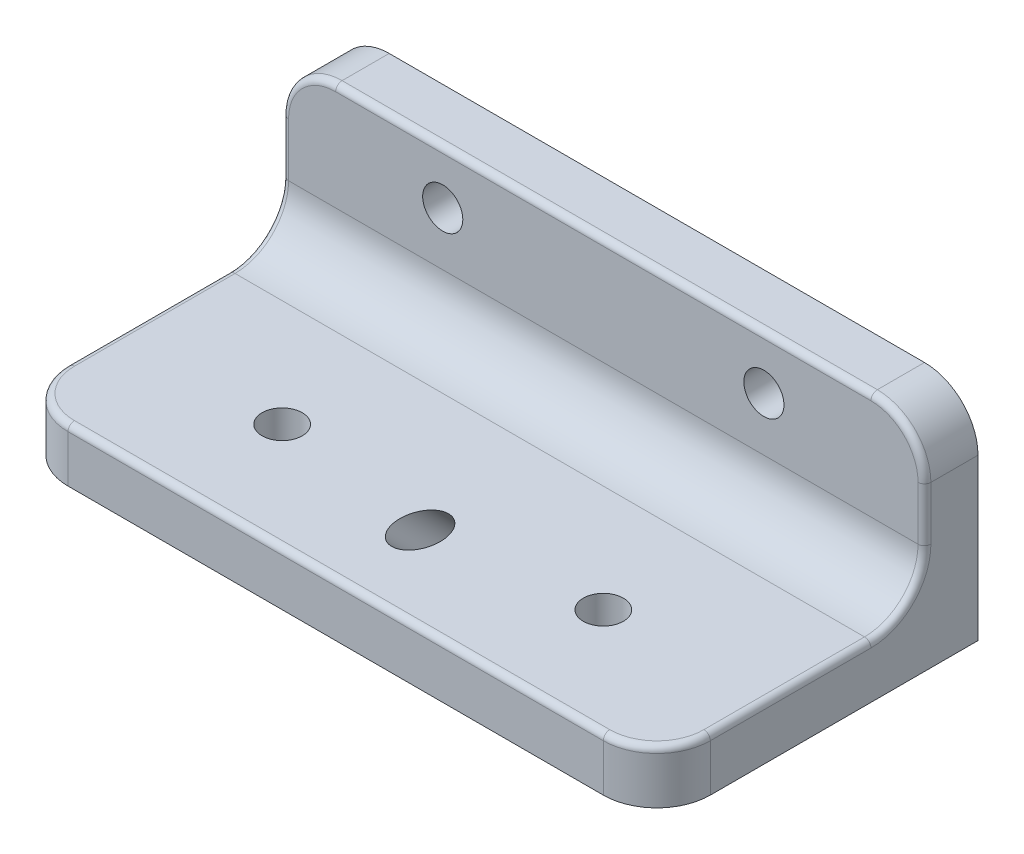
ISO-10303-21;
HEADER;
FILE_DESCRIPTION(('STEP AP214'),'2;1');
FILE_NAME('part.step','',(''),(''),'','','');
FILE_SCHEMA(('AUTOMOTIVE_DESIGN { 1 0 10303 214 1 1 1 1 }'));
ENDSEC;
DATA;
#1=APPLICATION_CONTEXT('core data for automotive mechanical design processes');
#2=APPLICATION_PROTOCOL_DEFINITION('international standard','automotive_design',2000,#1);
#3=PRODUCT_CONTEXT('',#1,'mechanical');
#4=PRODUCT('Part','Part','',(#3));
#5=PRODUCT_RELATED_PRODUCT_CATEGORY('part','',(#4));
#6=PRODUCT_DEFINITION_FORMATION('','',#4);
#7=PRODUCT_DEFINITION_CONTEXT('part definition',#1,'design');
#8=PRODUCT_DEFINITION('design','',#6,#7);
#9=PRODUCT_DEFINITION_SHAPE('','',#8);
#10=(LENGTH_UNIT() NAMED_UNIT(*) SI_UNIT(.MILLI.,.METRE.));
#11=(NAMED_UNIT(*) PLANE_ANGLE_UNIT() SI_UNIT($,.RADIAN.));
#12=(NAMED_UNIT(*) SI_UNIT($,.STERADIAN.) SOLID_ANGLE_UNIT());
#13=UNCERTAINTY_MEASURE_WITH_UNIT(LENGTH_MEASURE(1.E-05),#10,'distance_accuracy_value','');
#14=(GEOMETRIC_REPRESENTATION_CONTEXT(3) GLOBAL_UNCERTAINTY_ASSIGNED_CONTEXT((#13)) GLOBAL_UNIT_ASSIGNED_CONTEXT((#10,
#11,#12)) REPRESENTATION_CONTEXT('',''));
#15=CARTESIAN_POINT('',(0.,0.,0.));
#16=DIRECTION('',(0.,0.,1.));
#17=DIRECTION('',(1.,0.,0.));
#18=AXIS2_PLACEMENT_3D('',#15,#16,#17);
#19=CARTESIAN_POINT('',(0.,0.,3.175));
#20=DIRECTION('',(0.,0.,1.));
#21=DIRECTION('',(1.,0.,0.));
#22=AXIS2_PLACEMENT_3D('',#19,#20,#21);
#23=PLANE('',#22);
#24=CARTESIAN_POINT('',(28.575,-3.175,3.175));
#25=DIRECTION('',(0.,0.,1.));
#26=DIRECTION('',(-1.,0.,0.));
#27=AXIS2_PLACEMENT_3D('',#24,#25,#26);
#28=CIRCLE('',#27,1.190625);
#29=CARTESIAN_POINT('',(27.384375,-3.175,3.175));
#30=VERTEX_POINT('',#29);
#31=EDGE_CURVE('E320',#30,#30,#28,.T.);
#32=ORIENTED_EDGE('',*,*,#31,.F.);
#33=EDGE_LOOP('',(#32));
#34=FACE_BOUND('',#33,.T.);
#35=CARTESIAN_POINT('',(9.525,-3.175,3.175));
#36=DIRECTION('',(0.,0.,1.));
#37=DIRECTION('',(1.,0.,0.));
#38=AXIS2_PLACEMENT_3D('',#35,#36,#37);
#39=CIRCLE('',#38,1.190625);
#40=CARTESIAN_POINT('',(10.715625,-3.175,3.175));
#41=VERTEX_POINT('',#40);
#42=EDGE_CURVE('E175',#41,#41,#39,.T.);
#43=ORIENTED_EDGE('',*,*,#42,.F.);
#44=EDGE_LOOP('',(#43));
#45=FACE_BOUND('',#44,.T.);
#46=DIRECTION('',(1.,0.,0.));
#47=VECTOR('',#46,1.);
#48=CARTESIAN_POINT('',(38.1,-6.35,3.175));
#49=LINE('',#48,#47);
#50=CARTESIAN_POINT('',(0.380999999999999,-6.35,3.175));
#51=VERTEX_POINT('',#50);
#52=CARTESIAN_POINT('',(37.719,-6.35,3.175));
#53=VERTEX_POINT('',#52);
#54=EDGE_CURVE('E203',#51,#53,#49,.T.);
#55=ORIENTED_EDGE('',*,*,#54,.T.);
#56=DIRECTION('',(0.,1.,0.));
#57=VECTOR('',#56,1.);
#58=CARTESIAN_POINT('',(37.719,-3.175,3.175));
#59=LINE('',#58,#57);
#60=CARTESIAN_POINT('',(37.719,-3.175,3.175));
#61=VERTEX_POINT('',#60);
#62=EDGE_CURVE('E251',#53,#61,#59,.T.);
#63=ORIENTED_EDGE('',*,*,#62,.T.);
#64=CARTESIAN_POINT('',(34.925,-3.175,3.175));
#65=DIRECTION('',(0.,0.,1.));
#66=DIRECTION('',(1.,0.,0.));
#67=AXIS2_PLACEMENT_3D('',#64,#65,#66);
#68=CIRCLE('',#67,2.794);
#69=CARTESIAN_POINT('',(34.925,-0.381,3.175));
#70=VERTEX_POINT('',#69);
#71=EDGE_CURVE('E249',#61,#70,#68,.T.);
#72=ORIENTED_EDGE('',*,*,#71,.T.);
#73=DIRECTION('',(-1.,0.,0.));
#74=VECTOR('',#73,1.);
#75=CARTESIAN_POINT('',(3.175,-0.381,3.175));
#76=LINE('',#75,#74);
#77=CARTESIAN_POINT('',(3.175,-0.381,3.175));
#78=VERTEX_POINT('',#77);
#79=EDGE_CURVE('E247',#70,#78,#76,.T.);
#80=ORIENTED_EDGE('',*,*,#79,.T.);
#81=CARTESIAN_POINT('',(3.175,-3.175,3.175));
#82=DIRECTION('',(0.,0.,1.));
#83=DIRECTION('',(1.,0.,0.));
#84=AXIS2_PLACEMENT_3D('',#81,#82,#83);
#85=CIRCLE('',#84,2.794);
#86=CARTESIAN_POINT('',(0.381000000000001,-3.175,3.175));
#87=VERTEX_POINT('',#86);
#88=EDGE_CURVE('E245',#78,#87,#85,.T.);
#89=ORIENTED_EDGE('',*,*,#88,.T.);
#90=DIRECTION('',(0.,-1.,0.));
#91=VECTOR('',#90,1.);
#92=CARTESIAN_POINT('',(0.381000000000002,-6.35,3.175));
#93=LINE('',#92,#91);
#94=EDGE_CURVE('E243',#87,#51,#93,.T.);
#95=ORIENTED_EDGE('',*,*,#94,.T.);
#96=EDGE_LOOP('',(#55,#63,#72,#80,#89,#95));
#97=FACE_BOUND('',#96,.T.);
#98=ADVANCED_FACE('F33',(#34,#45,#97),#23,.T.);
#99=CARTESIAN_POINT('',(0.,0.,0.));
#100=DIRECTION('',(0.,0.,1.));
#101=DIRECTION('',(1.,0.,0.));
#102=AXIS2_PLACEMENT_3D('',#99,#100,#101);
#103=PLANE('',#102);
#104=CARTESIAN_POINT('',(9.525,-3.175,0.));
#105=DIRECTION('',(0.,0.,1.));
#106=DIRECTION('',(1.,0.,0.));
#107=AXIS2_PLACEMENT_3D('',#104,#105,#106);
#108=CIRCLE('',#107,1.190625);
#109=CARTESIAN_POINT('',(10.715625,-3.175,0.));
#110=VERTEX_POINT('',#109);
#111=EDGE_CURVE('E323',#110,#110,#108,.T.);
#112=ORIENTED_EDGE('',*,*,#111,.T.);
#113=EDGE_LOOP('',(#112));
#114=FACE_BOUND('',#113,.T.);
#115=DIRECTION('',(-1.,0.,0.));
#116=VECTOR('',#115,1.);
#117=CARTESIAN_POINT('',(0.,0.,0.));
#118=LINE('',#117,#116);
#119=CARTESIAN_POINT('',(34.925,0.,0.));
#120=VERTEX_POINT('',#119);
#121=CARTESIAN_POINT('',(3.175,0.,0.));
#122=VERTEX_POINT('',#121);
#123=EDGE_CURVE('E183',#120,#122,#118,.T.);
#124=ORIENTED_EDGE('',*,*,#123,.F.);
#125=CARTESIAN_POINT('',(34.925,-3.175,0.));
#126=DIRECTION('',(0.,0.,1.));
#127=DIRECTION('',(1.,0.,0.));
#128=AXIS2_PLACEMENT_3D('',#125,#126,#127);
#129=CIRCLE('',#128,3.175);
#130=CARTESIAN_POINT('',(38.1,-3.175,0.));
#131=VERTEX_POINT('',#130);
#132=EDGE_CURVE('E196',#120,#131,#129,.F.);
#133=ORIENTED_EDGE('',*,*,#132,.T.);
#134=DIRECTION('',(0.,1.,0.));
#135=VECTOR('',#134,1.);
#136=CARTESIAN_POINT('',(38.1,0.,0.));
#137=LINE('',#136,#135);
#138=CARTESIAN_POINT('',(38.1,-12.7,0.));
#139=VERTEX_POINT('',#138);
#140=EDGE_CURVE('E181',#139,#131,#137,.T.);
#141=ORIENTED_EDGE('',*,*,#140,.F.);
#142=DIRECTION('',(1.,0.,0.));
#143=VECTOR('',#142,1.);
#144=CARTESIAN_POINT('',(0.,-12.7,0.));
#145=LINE('',#144,#143);
#146=CARTESIAN_POINT('',(0.,-12.7,0.));
#147=VERTEX_POINT('',#146);
#148=EDGE_CURVE('E158',#147,#139,#145,.T.);
#149=ORIENTED_EDGE('',*,*,#148,.F.);
#150=DIRECTION('',(0.,-1.,0.));
#151=VECTOR('',#150,1.);
#152=CARTESIAN_POINT('',(0.,0.,0.));
#153=LINE('',#152,#151);
#154=CARTESIAN_POINT('',(0.,-3.175,0.));
#155=VERTEX_POINT('',#154);
#156=EDGE_CURVE('E169',#155,#147,#153,.T.);
#157=ORIENTED_EDGE('',*,*,#156,.F.);
#158=CARTESIAN_POINT('',(3.175,-3.175,0.));
#159=DIRECTION('',(0.,0.,1.));
#160=DIRECTION('',(1.,0.,0.));
#161=AXIS2_PLACEMENT_3D('',#158,#159,#160);
#162=CIRCLE('',#161,3.175);
#163=EDGE_CURVE('E194',#155,#122,#162,.F.);
#164=ORIENTED_EDGE('',*,*,#163,.T.);
#165=EDGE_LOOP('',(#124,#133,#141,#149,#157,#164));
#166=FACE_BOUND('',#165,.T.);
#167=CARTESIAN_POINT('',(28.575,-3.175,0.));
#168=DIRECTION('',(0.,0.,1.));
#169=DIRECTION('',(-1.,0.,0.));
#170=AXIS2_PLACEMENT_3D('',#167,#168,#169);
#171=CIRCLE('',#170,1.190625);
#172=CARTESIAN_POINT('',(27.384375,-3.175,0.));
#173=VERTEX_POINT('',#172);
#174=EDGE_CURVE('E319',#173,#173,#171,.T.);
#175=ORIENTED_EDGE('',*,*,#174,.T.);
#176=EDGE_LOOP('',(#175));
#177=FACE_BOUND('',#176,.T.);
#178=ADVANCED_FACE('F178',(#114,#166,#177),#103,.F.);
#179=CARTESIAN_POINT('',(0.,0.,3.175));
#180=DIRECTION('',(1.,0.,0.));
#181=DIRECTION('',(0.,1.,0.));
#182=AXIS2_PLACEMENT_3D('',#179,#180,#181);
#183=PLANE('',#182);
#184=CARTESIAN_POINT('',(0.,-6.35,6.35));
#185=DIRECTION('',(1.,0.,0.));
#186=DIRECTION('',(0.,1.,0.));
#187=AXIS2_PLACEMENT_3D('',#184,#185,#186);
#188=CIRCLE('',#187,3.556);
#189=CARTESIAN_POINT('',(0.,-9.906,6.35));
#190=VERTEX_POINT('',#189);
#191=CARTESIAN_POINT('',(0.,-6.35,2.794));
#192=VERTEX_POINT('',#191);
#193=EDGE_CURVE('E56',#190,#192,#188,.T.);
#194=ORIENTED_EDGE('',*,*,#193,.T.);
#195=DIRECTION('',(0.,-1.,0.));
#196=VECTOR('',#195,1.);
#197=CARTESIAN_POINT('',(0.,-3.175,2.794));
#198=LINE('',#197,#196);
#199=CARTESIAN_POINT('',(0.,-3.175,2.794));
#200=VERTEX_POINT('',#199);
#201=EDGE_CURVE('E262',#192,#200,#198,.F.);
#202=ORIENTED_EDGE('',*,*,#201,.T.);
#203=DIRECTION('',(0.,0.,-1.));
#204=VECTOR('',#203,1.);
#205=CARTESIAN_POINT('',(0.,-3.175,3.175));
#206=LINE('',#205,#204);
#207=EDGE_CURVE('E172',#200,#155,#206,.T.);
#208=ORIENTED_EDGE('',*,*,#207,.T.);
#209=ORIENTED_EDGE('',*,*,#156,.T.);
#210=DIRECTION('',(0.,0.,-1.));
#211=VECTOR('',#210,1.);
#212=CARTESIAN_POINT('',(0.,-12.7,3.175));
#213=LINE('',#212,#211);
#214=CARTESIAN_POINT('',(0.,-12.7,15.875));
#215=VERTEX_POINT('',#214);
#216=EDGE_CURVE('E153',#215,#147,#213,.T.);
#217=ORIENTED_EDGE('',*,*,#216,.F.);
#218=DIRECTION('',(0.,-1.,0.));
#219=VECTOR('',#218,1.);
#220=CARTESIAN_POINT('',(0.,-9.525,15.875));
#221=LINE('',#220,#219);
#222=CARTESIAN_POINT('',(0.,-9.906,15.875));
#223=VERTEX_POINT('',#222);
#224=EDGE_CURVE('E206',#215,#223,#221,.F.);
#225=ORIENTED_EDGE('',*,*,#224,.T.);
#226=DIRECTION('',(0.,0.,-1.));
#227=VECTOR('',#226,1.);
#228=CARTESIAN_POINT('',(0.,-9.906,6.35));
#229=LINE('',#228,#227);
#230=EDGE_CURVE('E259',#223,#190,#229,.T.);
#231=ORIENTED_EDGE('',*,*,#230,.T.);
#232=EDGE_LOOP('',(#194,#202,#208,#209,#217,#225,#231));
#233=FACE_BOUND('',#232,.T.);
#234=ADVANCED_FACE('F170',(#233),#183,.F.);
#235=CARTESIAN_POINT('',(0.,-12.7,3.175));
#236=DIRECTION('',(0.,1.,0.));
#237=DIRECTION('',(0.,0.,1.));
#238=AXIS2_PLACEMENT_3D('',#235,#236,#237);
#239=PLANE('',#238);
#240=CARTESIAN_POINT('',(28.575,-12.7,12.7));
#241=DIRECTION('',(0.,-1.,0.));
#242=DIRECTION('',(0.,0.,1.));
#243=AXIS2_PLACEMENT_3D('',#240,#241,#242);
#244=CIRCLE('',#243,1.190625);
#245=CARTESIAN_POINT('',(28.575,-12.7,13.890625));
#246=VERTEX_POINT('',#245);
#247=EDGE_CURVE('E313',#246,#246,#244,.T.);
#248=ORIENTED_EDGE('',*,*,#247,.F.);
#249=EDGE_LOOP('',(#248));
#250=FACE_BOUND('',#249,.T.);
#251=CARTESIAN_POINT('',(9.525,-12.7,12.7));
#252=DIRECTION('',(0.,-1.,0.));
#253=DIRECTION('',(0.,0.,-1.));
#254=AXIS2_PLACEMENT_3D('',#251,#252,#253);
#255=CIRCLE('',#254,1.190625);
#256=CARTESIAN_POINT('',(9.525,-12.7,11.509375));
#257=VERTEX_POINT('',#256);
#258=EDGE_CURVE('E305',#257,#257,#255,.T.);
#259=ORIENTED_EDGE('',*,*,#258,.F.);
#260=EDGE_LOOP('',(#259));
#261=FACE_BOUND('',#260,.T.);
#262=CARTESIAN_POINT('',(19.05,-12.7,10.8678463273585));
#263=DIRECTION('',(0.,1.,0.));
#264=DIRECTION('',(0.,0.,1.));
#265=AXIS2_PLACEMENT_3D('',#262,#263,#264);
#266=ELLIPSE('',#265,1.68379802270047,1.190625);
#267=CARTESIAN_POINT('',(19.05,-12.7,12.551644350059));
#268=VERTEX_POINT('',#267);
#269=EDGE_CURVE('E268',#268,#268,#266,.T.);
#270=ORIENTED_EDGE('',*,*,#269,.T.);
#271=EDGE_LOOP('',(#270));
#272=FACE_BOUND('',#271,.T.);
#273=DIRECTION('',(0.,0.,-1.));
#274=VECTOR('',#273,1.);
#275=CARTESIAN_POINT('',(38.1,-12.7,3.175));
#276=LINE('',#275,#274);
#277=CARTESIAN_POINT('',(38.1,-12.7,15.875));
#278=VERTEX_POINT('',#277);
#279=EDGE_CURVE('E166',#278,#139,#276,.T.);
#280=ORIENTED_EDGE('',*,*,#279,.F.);
#281=CARTESIAN_POINT('',(34.925,-12.7,15.875));
#282=DIRECTION('',(0.,1.,0.));
#283=DIRECTION('',(0.,0.,1.));
#284=AXIS2_PLACEMENT_3D('',#281,#282,#283);
#285=CIRCLE('',#284,3.175);
#286=CARTESIAN_POINT('',(34.925,-12.7,19.05));
#287=VERTEX_POINT('',#286);
#288=EDGE_CURVE('E213',#278,#287,#285,.F.);
#289=ORIENTED_EDGE('',*,*,#288,.T.);
#290=DIRECTION('',(-1.,0.,0.));
#291=VECTOR('',#290,1.);
#292=CARTESIAN_POINT('',(0.,-12.7,19.05));
#293=LINE('',#292,#291);
#294=CARTESIAN_POINT('',(3.175,-12.7,19.05));
#295=VERTEX_POINT('',#294);
#296=EDGE_CURVE('E300',#287,#295,#293,.T.);
#297=ORIENTED_EDGE('',*,*,#296,.T.);
#298=CARTESIAN_POINT('',(3.175,-12.7,15.875));
#299=DIRECTION('',(0.,1.,0.));
#300=DIRECTION('',(0.,0.,1.));
#301=AXIS2_PLACEMENT_3D('',#298,#299,#300);
#302=CIRCLE('',#301,3.175);
#303=EDGE_CURVE('E162',#295,#215,#302,.F.);
#304=ORIENTED_EDGE('',*,*,#303,.T.);
#305=ORIENTED_EDGE('',*,*,#216,.T.);
#306=ORIENTED_EDGE('',*,*,#148,.T.);
#307=EDGE_LOOP('',(#280,#289,#297,#304,#305,#306));
#308=FACE_BOUND('',#307,.T.);
#309=ADVANCED_FACE('F156',(#250,#261,#272,#308),#239,.F.);
#310=CARTESIAN_POINT('',(38.1,0.,3.175));
#311=DIRECTION('',(-1.,0.,0.));
#312=DIRECTION('',(0.,0.,1.));
#313=AXIS2_PLACEMENT_3D('',#310,#311,#312);
#314=PLANE('',#313);
#315=CARTESIAN_POINT('',(38.1,-6.35,6.35));
#316=DIRECTION('',(-1.,0.,0.));
#317=DIRECTION('',(0.,0.,1.));
#318=AXIS2_PLACEMENT_3D('',#315,#316,#317);
#319=CIRCLE('',#318,3.556);
#320=CARTESIAN_POINT('',(38.1,-6.35,2.794));
#321=VERTEX_POINT('',#320);
#322=CARTESIAN_POINT('',(38.1,-9.906,6.35));
#323=VERTEX_POINT('',#322);
#324=EDGE_CURVE('E235',#321,#323,#319,.T.);
#325=ORIENTED_EDGE('',*,*,#324,.T.);
#326=DIRECTION('',(0.,0.,1.));
#327=VECTOR('',#326,1.);
#328=CARTESIAN_POINT('',(38.1,-9.906,15.875));
#329=LINE('',#328,#327);
#330=CARTESIAN_POINT('',(38.1,-9.906,15.875));
#331=VERTEX_POINT('',#330);
#332=EDGE_CURVE('E237',#323,#331,#329,.T.);
#333=ORIENTED_EDGE('',*,*,#332,.T.);
#334=DIRECTION('',(0.,-1.,0.));
#335=VECTOR('',#334,1.);
#336=CARTESIAN_POINT('',(38.1,-12.7,15.875));
#337=LINE('',#336,#335);
#338=EDGE_CURVE('E198',#331,#278,#337,.T.);
#339=ORIENTED_EDGE('',*,*,#338,.T.);
#340=ORIENTED_EDGE('',*,*,#279,.T.);
#341=ORIENTED_EDGE('',*,*,#140,.T.);
#342=DIRECTION('',(0.,0.,-1.));
#343=VECTOR('',#342,1.);
#344=CARTESIAN_POINT('',(38.1,-3.175,3.175));
#345=LINE('',#344,#343);
#346=CARTESIAN_POINT('',(38.1,-3.175,2.794));
#347=VERTEX_POINT('',#346);
#348=EDGE_CURVE('E200',#131,#347,#345,.F.);
#349=ORIENTED_EDGE('',*,*,#348,.T.);
#350=DIRECTION('',(0.,1.,0.));
#351=VECTOR('',#350,1.);
#352=CARTESIAN_POINT('',(38.1,-6.35,2.794));
#353=LINE('',#352,#351);
#354=EDGE_CURVE('E233',#347,#321,#353,.F.);
#355=ORIENTED_EDGE('',*,*,#354,.T.);
#356=EDGE_LOOP('',(#325,#333,#339,#340,#341,#349,#355));
#357=FACE_BOUND('',#356,.T.);
#358=ADVANCED_FACE('F344',(#357),#314,.F.);
#359=CARTESIAN_POINT('',(0.,0.,3.175));
#360=DIRECTION('',(0.,-1.,0.));
#361=DIRECTION('',(0.,0.,-1.));
#362=AXIS2_PLACEMENT_3D('',#359,#360,#361);
#363=PLANE('',#362);
#364=DIRECTION('',(0.,0.,-1.));
#365=VECTOR('',#364,1.);
#366=CARTESIAN_POINT('',(3.175,0.,3.175));
#367=LINE('',#366,#365);
#368=CARTESIAN_POINT('',(3.175,0.,2.794));
#369=VERTEX_POINT('',#368);
#370=EDGE_CURVE('E165',#122,#369,#367,.F.);
#371=ORIENTED_EDGE('',*,*,#370,.T.);
#372=DIRECTION('',(-1.,0.,0.));
#373=VECTOR('',#372,1.);
#374=CARTESIAN_POINT('',(34.925,0.,2.794));
#375=LINE('',#374,#373);
#376=CARTESIAN_POINT('',(34.925,0.,2.794));
#377=VERTEX_POINT('',#376);
#378=EDGE_CURVE('E255',#369,#377,#375,.F.);
#379=ORIENTED_EDGE('',*,*,#378,.T.);
#380=DIRECTION('',(0.,0.,-1.));
#381=VECTOR('',#380,1.);
#382=CARTESIAN_POINT('',(34.925,0.,3.175));
#383=LINE('',#382,#381);
#384=EDGE_CURVE('E192',#377,#120,#383,.T.);
#385=ORIENTED_EDGE('',*,*,#384,.T.);
#386=ORIENTED_EDGE('',*,*,#123,.T.);
#387=EDGE_LOOP('',(#371,#379,#385,#386));
#388=FACE_BOUND('',#387,.T.);
#389=ADVANCED_FACE('F334',(#388),#363,.F.);
#390=CARTESIAN_POINT('',(9.525,-3.175,3.175));
#391=DIRECTION('',(0.,0.,-1.));
#392=DIRECTION('',(-1.,0.,0.));
#393=AXIS2_PLACEMENT_3D('',#390,#391,#392);
#394=CYLINDRICAL_SURFACE('',#393,1.190625);
#395=ORIENTED_EDGE('',*,*,#42,.T.);
#396=EDGE_LOOP('',(#395));
#397=FACE_BOUND('',#396,.T.);
#398=ORIENTED_EDGE('',*,*,#111,.F.);
#399=EDGE_LOOP('',(#398));
#400=FACE_BOUND('',#399,.T.);
#401=ADVANCED_FACE('F331',(#397,#400),#394,.F.);
#402=CARTESIAN_POINT('',(28.575,-3.175,3.175));
#403=DIRECTION('',(0.,0.,-1.));
#404=DIRECTION('',(-1.,0.,0.));
#405=AXIS2_PLACEMENT_3D('',#402,#403,#404);
#406=CYLINDRICAL_SURFACE('',#405,1.190625);
#407=ORIENTED_EDGE('',*,*,#31,.T.);
#408=EDGE_LOOP('',(#407));
#409=FACE_BOUND('',#408,.T.);
#410=ORIENTED_EDGE('',*,*,#174,.F.);
#411=EDGE_LOOP('',(#410));
#412=FACE_BOUND('',#411,.T.);
#413=ADVANCED_FACE('F333',(#409,#412),#406,.F.);
#414=CARTESIAN_POINT('',(0.,-9.525,19.05));
#415=DIRECTION('',(0.,0.,1.));
#416=DIRECTION('',(1.,0.,0.));
#417=AXIS2_PLACEMENT_3D('',#414,#415,#416);
#418=PLANE('',#417);
#419=DIRECTION('',(0.,-1.,0.));
#420=VECTOR('',#419,1.);
#421=CARTESIAN_POINT('',(34.925,-9.525,19.05));
#422=LINE('',#421,#420);
#423=CARTESIAN_POINT('',(34.925,-9.906,19.05));
#424=VERTEX_POINT('',#423);
#425=EDGE_CURVE('E217',#287,#424,#422,.F.);
#426=ORIENTED_EDGE('',*,*,#425,.T.);
#427=DIRECTION('',(-1.,0.,0.));
#428=VECTOR('',#427,1.);
#429=CARTESIAN_POINT('',(0.,-9.906,19.05));
#430=LINE('',#429,#428);
#431=CARTESIAN_POINT('',(3.175,-9.906,19.05));
#432=VERTEX_POINT('',#431);
#433=EDGE_CURVE('E11',#424,#432,#430,.T.);
#434=ORIENTED_EDGE('',*,*,#433,.T.);
#435=DIRECTION('',(0.,-1.,0.));
#436=VECTOR('',#435,1.);
#437=CARTESIAN_POINT('',(3.175,-12.7,19.05));
#438=LINE('',#437,#436);
#439=EDGE_CURVE('E215',#432,#295,#438,.T.);
#440=ORIENTED_EDGE('',*,*,#439,.T.);
#441=ORIENTED_EDGE('',*,*,#296,.F.);
#442=EDGE_LOOP('',(#426,#434,#440,#441));
#443=FACE_BOUND('',#442,.T.);
#444=ADVANCED_FACE('F341',(#443),#418,.T.);
#445=CARTESIAN_POINT('',(0.,-9.525,0.));
#446=DIRECTION('',(0.,1.,0.));
#447=DIRECTION('',(0.,0.,1.));
#448=AXIS2_PLACEMENT_3D('',#445,#446,#447);
#449=PLANE('',#448);
#450=CARTESIAN_POINT('',(28.575,-9.525,12.7));
#451=DIRECTION('',(0.,1.,0.));
#452=DIRECTION('',(0.,0.,1.));
#453=AXIS2_PLACEMENT_3D('',#450,#451,#452);
#454=CIRCLE('',#453,1.190625);
#455=CARTESIAN_POINT('',(28.575,-9.525,13.890625));
#456=VERTEX_POINT('',#455);
#457=EDGE_CURVE('E37',#456,#456,#454,.T.);
#458=ORIENTED_EDGE('',*,*,#457,.F.);
#459=EDGE_LOOP('',(#458));
#460=FACE_BOUND('',#459,.T.);
#461=CARTESIAN_POINT('',(9.525,-9.525,12.7));
#462=DIRECTION('',(0.,1.,0.));
#463=DIRECTION('',(0.,0.,1.));
#464=AXIS2_PLACEMENT_3D('',#461,#462,#463);
#465=CIRCLE('',#464,1.190625);
#466=CARTESIAN_POINT('',(9.525,-9.525,13.890625));
#467=VERTEX_POINT('',#466);
#468=EDGE_CURVE('E303',#467,#467,#465,.T.);
#469=ORIENTED_EDGE('',*,*,#468,.F.);
#470=EDGE_LOOP('',(#469));
#471=FACE_BOUND('',#470,.T.);
#472=CARTESIAN_POINT('',(19.05,-9.525,14.0428463273585));
#473=DIRECTION('',(0.,1.,0.));
#474=DIRECTION('',(0.,0.,1.));
#475=AXIS2_PLACEMENT_3D('',#472,#473,#474);
#476=ELLIPSE('',#475,1.68379802270047,1.190625);
#477=CARTESIAN_POINT('',(19.05,-9.525,15.726644350059));
#478=VERTEX_POINT('',#477);
#479=EDGE_CURVE('E301',#478,#478,#476,.T.);
#480=ORIENTED_EDGE('',*,*,#479,.F.);
#481=EDGE_LOOP('',(#480));
#482=FACE_BOUND('',#481,.T.);
#483=CARTESIAN_POINT('',(34.925,-9.525,15.875));
#484=DIRECTION('',(0.,1.,0.));
#485=DIRECTION('',(0.,0.,1.));
#486=AXIS2_PLACEMENT_3D('',#483,#484,#485);
#487=CIRCLE('',#486,2.794);
#488=CARTESIAN_POINT('',(34.925,-9.525,18.669));
#489=VERTEX_POINT('',#488);
#490=CARTESIAN_POINT('',(37.719,-9.525,15.875));
#491=VERTEX_POINT('',#490);
#492=EDGE_CURVE('E225',#489,#491,#487,.T.);
#493=ORIENTED_EDGE('',*,*,#492,.T.);
#494=DIRECTION('',(0.,0.,1.));
#495=VECTOR('',#494,1.);
#496=CARTESIAN_POINT('',(37.719,-9.525,6.35));
#497=LINE('',#496,#495);
#498=CARTESIAN_POINT('',(37.719,-9.525,6.35));
#499=VERTEX_POINT('',#498);
#500=EDGE_CURVE('E228',#491,#499,#497,.F.);
#501=ORIENTED_EDGE('',*,*,#500,.T.);
#502=DIRECTION('',(1.,0.,0.));
#503=VECTOR('',#502,1.);
#504=CARTESIAN_POINT('',(0.,-9.525,6.35));
#505=LINE('',#504,#503);
#506=CARTESIAN_POINT('',(0.381000000000003,-9.525,6.35));
#507=VERTEX_POINT('',#506);
#508=EDGE_CURVE('E209',#499,#507,#505,.F.);
#509=ORIENTED_EDGE('',*,*,#508,.T.);
#510=DIRECTION('',(0.,0.,-1.));
#511=VECTOR('',#510,1.);
#512=CARTESIAN_POINT('',(0.381000000000003,-9.525,15.875));
#513=LINE('',#512,#511);
#514=CARTESIAN_POINT('',(0.381000000000002,-9.525,15.875));
#515=VERTEX_POINT('',#514);
#516=EDGE_CURVE('E223',#507,#515,#513,.F.);
#517=ORIENTED_EDGE('',*,*,#516,.T.);
#518=CARTESIAN_POINT('',(3.175,-9.525,15.875));
#519=DIRECTION('',(0.,1.,0.));
#520=DIRECTION('',(0.,0.,1.));
#521=AXIS2_PLACEMENT_3D('',#518,#519,#520);
#522=CIRCLE('',#521,2.794);
#523=CARTESIAN_POINT('',(3.175,-9.525,18.669));
#524=VERTEX_POINT('',#523);
#525=EDGE_CURVE('E221',#515,#524,#522,.T.);
#526=ORIENTED_EDGE('',*,*,#525,.T.);
#527=DIRECTION('',(-1.,0.,0.));
#528=VECTOR('',#527,1.);
#529=CARTESIAN_POINT('',(0.,-9.525,18.669));
#530=LINE('',#529,#528);
#531=EDGE_CURVE('E219',#524,#489,#530,.F.);
#532=ORIENTED_EDGE('',*,*,#531,.T.);
#533=EDGE_LOOP('',(#493,#501,#509,#517,#526,#532));
#534=FACE_BOUND('',#533,.T.);
#535=ADVANCED_FACE('F369',(#460,#471,#482,#534),#449,.T.);
#536=CARTESIAN_POINT('',(34.925,-3.175,3.175));
#537=DIRECTION('',(0.,0.,-1.));
#538=DIRECTION('',(-1.,0.,0.));
#539=AXIS2_PLACEMENT_3D('',#536,#537,#538);
#540=CYLINDRICAL_SURFACE('',#539,3.175);
#541=ORIENTED_EDGE('',*,*,#384,.F.);
#542=CARTESIAN_POINT('',(34.925,-3.175,2.794));
#543=DIRECTION('',(0.,0.,1.));
#544=DIRECTION('',(1.,0.,0.));
#545=AXIS2_PLACEMENT_3D('',#542,#543,#544);
#546=CIRCLE('',#545,3.175);
#547=EDGE_CURVE('E253',#377,#347,#546,.F.);
#548=ORIENTED_EDGE('',*,*,#547,.T.);
#549=ORIENTED_EDGE('',*,*,#348,.F.);
#550=ORIENTED_EDGE('',*,*,#132,.F.);
#551=EDGE_LOOP('',(#541,#548,#549,#550));
#552=FACE_BOUND('',#551,.T.);
#553=ADVANCED_FACE('F365',(#552),#540,.T.);
#554=CARTESIAN_POINT('',(3.175,-3.175,3.175));
#555=DIRECTION('',(0.,0.,-1.));
#556=DIRECTION('',(-1.,0.,0.));
#557=AXIS2_PLACEMENT_3D('',#554,#555,#556);
#558=CYLINDRICAL_SURFACE('',#557,3.175);
#559=ORIENTED_EDGE('',*,*,#207,.F.);
#560=CARTESIAN_POINT('',(3.175,-3.175,2.794));
#561=DIRECTION('',(0.,0.,1.));
#562=DIRECTION('',(1.,0.,0.));
#563=AXIS2_PLACEMENT_3D('',#560,#561,#562);
#564=CIRCLE('',#563,3.175);
#565=EDGE_CURVE('E257',#200,#369,#564,.F.);
#566=ORIENTED_EDGE('',*,*,#565,.T.);
#567=ORIENTED_EDGE('',*,*,#370,.F.);
#568=ORIENTED_EDGE('',*,*,#163,.F.);
#569=EDGE_LOOP('',(#559,#566,#567,#568));
#570=FACE_BOUND('',#569,.T.);
#571=ADVANCED_FACE('F368',(#570),#558,.T.);
#572=CARTESIAN_POINT('',(0.,-6.35,6.35));
#573=DIRECTION('',(-1.,0.,0.));
#574=DIRECTION('',(0.,0.,1.));
#575=AXIS2_PLACEMENT_3D('',#572,#573,#574);
#576=CYLINDRICAL_SURFACE('',#575,3.175);
#577=ORIENTED_EDGE('',*,*,#508,.F.);
#578=CARTESIAN_POINT('',(37.719,-6.35,6.35));
#579=DIRECTION('',(-1.,0.,0.));
#580=DIRECTION('',(0.,0.,1.));
#581=AXIS2_PLACEMENT_3D('',#578,#579,#580);
#582=CIRCLE('',#581,3.175);
#583=EDGE_CURVE('E241',#499,#53,#582,.F.);
#584=ORIENTED_EDGE('',*,*,#583,.T.);
#585=ORIENTED_EDGE('',*,*,#54,.F.);
#586=CARTESIAN_POINT('',(0.381000000000002,-6.35,6.35));
#587=DIRECTION('',(1.,0.,0.));
#588=DIRECTION('',(0.,1.,0.));
#589=AXIS2_PLACEMENT_3D('',#586,#587,#588);
#590=CIRCLE('',#589,3.175);
#591=EDGE_CURVE('E239',#51,#507,#590,.F.);
#592=ORIENTED_EDGE('',*,*,#591,.T.);
#593=EDGE_LOOP('',(#577,#584,#585,#592));
#594=FACE_BOUND('',#593,.T.);
#595=ADVANCED_FACE('F373',(#594),#576,.F.);
#596=CARTESIAN_POINT('',(34.925,0.,15.875));
#597=DIRECTION('',(0.,1.,0.));
#598=DIRECTION('',(0.,0.,1.));
#599=AXIS2_PLACEMENT_3D('',#596,#597,#598);
#600=CYLINDRICAL_SURFACE('',#599,3.175);
#601=ORIENTED_EDGE('',*,*,#338,.F.);
#602=CARTESIAN_POINT('',(34.925,-9.906,15.875));
#603=DIRECTION('',(0.,1.,0.));
#604=DIRECTION('',(0.,0.,1.));
#605=AXIS2_PLACEMENT_3D('',#602,#603,#604);
#606=CIRCLE('',#605,3.175);
#607=EDGE_CURVE('E230',#331,#424,#606,.F.);
#608=ORIENTED_EDGE('',*,*,#607,.T.);
#609=ORIENTED_EDGE('',*,*,#425,.F.);
#610=ORIENTED_EDGE('',*,*,#288,.F.);
#611=EDGE_LOOP('',(#601,#608,#609,#610));
#612=FACE_BOUND('',#611,.T.);
#613=ADVANCED_FACE('F377',(#612),#600,.T.);
#614=CARTESIAN_POINT('',(3.175,-9.525,15.875));
#615=DIRECTION('',(0.,1.,0.));
#616=DIRECTION('',(-1.,0.,0.));
#617=AXIS2_PLACEMENT_3D('',#614,#615,#616);
#618=CYLINDRICAL_SURFACE('',#617,3.175);
#619=ORIENTED_EDGE('',*,*,#439,.F.);
#620=CARTESIAN_POINT('',(3.175,-9.906,15.875));
#621=DIRECTION('',(0.,1.,0.));
#622=DIRECTION('',(0.,0.,1.));
#623=AXIS2_PLACEMENT_3D('',#620,#621,#622);
#624=CIRCLE('',#623,3.175);
#625=EDGE_CURVE('E42',#432,#223,#624,.F.);
#626=ORIENTED_EDGE('',*,*,#625,.T.);
#627=ORIENTED_EDGE('',*,*,#224,.F.);
#628=ORIENTED_EDGE('',*,*,#303,.F.);
#629=EDGE_LOOP('',(#619,#626,#627,#628));
#630=FACE_BOUND('',#629,.T.);
#631=ADVANCED_FACE('F381',(#630),#618,.T.);
#632=CARTESIAN_POINT('',(3.175,-3.175,2.794));
#633=DIRECTION('',(0.,0.,1.));
#634=DIRECTION('',(1.,0.,0.));
#635=AXIS2_PLACEMENT_3D('',#632,#633,#634);
#636=TOROIDAL_SURFACE('',#635,2.794,0.381);
#637=CARTESIAN_POINT('',(3.175,-0.381,2.794));
#638=DIRECTION('',(1.,0.,0.));
#639=DIRECTION('',(0.,0.,-1.));
#640=AXIS2_PLACEMENT_3D('',#637,#638,#639);
#641=CIRCLE('',#640,0.381);
#642=EDGE_CURVE('E294',#369,#78,#641,.T.);
#643=ORIENTED_EDGE('',*,*,#642,.F.);
#644=ORIENTED_EDGE('',*,*,#565,.F.);
#645=CARTESIAN_POINT('',(0.381000000000001,-3.175,2.794));
#646=DIRECTION('',(0.,-1.,0.));
#647=DIRECTION('',(0.,0.,-1.));
#648=AXIS2_PLACEMENT_3D('',#645,#646,#647);
#649=CIRCLE('',#648,0.381);
#650=EDGE_CURVE('E297',#87,#200,#649,.T.);
#651=ORIENTED_EDGE('',*,*,#650,.F.);
#652=ORIENTED_EDGE('',*,*,#88,.F.);
#653=EDGE_LOOP('',(#643,#644,#651,#652));
#654=FACE_BOUND('',#653,.T.);
#655=ADVANCED_FACE('F35',(#654),#636,.T.);
#656=CARTESIAN_POINT('',(0.381,0.,2.794));
#657=DIRECTION('',(0.,1.,0.));
#658=DIRECTION('',(-1.,0.,0.));
#659=AXIS2_PLACEMENT_3D('',#656,#657,#658);
#660=CYLINDRICAL_SURFACE('',#659,0.381);
#661=ORIENTED_EDGE('',*,*,#650,.T.);
#662=ORIENTED_EDGE('',*,*,#201,.F.);
#663=CARTESIAN_POINT('',(0.381000000000002,-6.35,2.794));
#664=DIRECTION('',(0.,-1.,0.));
#665=DIRECTION('',(0.,0.,-1.));
#666=AXIS2_PLACEMENT_3D('',#663,#664,#665);
#667=CIRCLE('',#666,0.381);
#668=EDGE_CURVE('E291',#51,#192,#667,.T.);
#669=ORIENTED_EDGE('',*,*,#668,.F.);
#670=ORIENTED_EDGE('',*,*,#94,.F.);
#671=EDGE_LOOP('',(#661,#662,#669,#670));
#672=FACE_BOUND('',#671,.T.);
#673=ADVANCED_FACE('F425',(#672),#660,.T.);
#674=CARTESIAN_POINT('',(0.,-0.381,2.794));
#675=DIRECTION('',(1.,0.,0.));
#676=DIRECTION('',(0.,0.,-1.));
#677=AXIS2_PLACEMENT_3D('',#674,#675,#676);
#678=CYLINDRICAL_SURFACE('',#677,0.381);
#679=ORIENTED_EDGE('',*,*,#642,.T.);
#680=ORIENTED_EDGE('',*,*,#79,.F.);
#681=CARTESIAN_POINT('',(34.925,-0.381,2.794));
#682=DIRECTION('',(1.,0.,0.));
#683=DIRECTION('',(0.,0.,-1.));
#684=AXIS2_PLACEMENT_3D('',#681,#682,#683);
#685=CIRCLE('',#684,0.381);
#686=EDGE_CURVE('E288',#377,#70,#685,.T.);
#687=ORIENTED_EDGE('',*,*,#686,.F.);
#688=ORIENTED_EDGE('',*,*,#378,.F.);
#689=EDGE_LOOP('',(#679,#680,#687,#688));
#690=FACE_BOUND('',#689,.T.);
#691=ADVANCED_FACE('F422',(#690),#678,.T.);
#692=CARTESIAN_POINT('',(0.381000000000002,-6.35,6.35));
#693=DIRECTION('',(1.,0.,0.));
#694=DIRECTION('',(0.,1.,0.));
#695=AXIS2_PLACEMENT_3D('',#692,#693,#694);
#696=TOROIDAL_SURFACE('',#695,3.556,0.381);
#697=ORIENTED_EDGE('',*,*,#668,.T.);
#698=ORIENTED_EDGE('',*,*,#193,.F.);
#699=CARTESIAN_POINT('',(0.381000000000003,-9.906,6.35));
#700=DIRECTION('',(0.,0.,1.));
#701=DIRECTION('',(1.,0.,0.));
#702=AXIS2_PLACEMENT_3D('',#699,#700,#701);
#703=CIRCLE('',#702,0.381);
#704=EDGE_CURVE('E285',#507,#190,#703,.T.);
#705=ORIENTED_EDGE('',*,*,#704,.F.);
#706=ORIENTED_EDGE('',*,*,#591,.F.);
#707=EDGE_LOOP('',(#697,#698,#705,#706));
#708=FACE_BOUND('',#707,.T.);
#709=ADVANCED_FACE('F418',(#708),#696,.T.);
#710=CARTESIAN_POINT('',(34.925,-3.175,2.794));
#711=DIRECTION('',(0.,0.,1.));
#712=DIRECTION('',(1.,0.,0.));
#713=AXIS2_PLACEMENT_3D('',#710,#711,#712);
#714=TOROIDAL_SURFACE('',#713,2.794,0.381);
#715=ORIENTED_EDGE('',*,*,#686,.T.);
#716=ORIENTED_EDGE('',*,*,#71,.F.);
#717=CARTESIAN_POINT('',(37.719,-3.175,2.794));
#718=DIRECTION('',(0.,-1.,0.));
#719=DIRECTION('',(0.,0.,-1.));
#720=AXIS2_PLACEMENT_3D('',#717,#718,#719);
#721=CIRCLE('',#720,0.381);
#722=EDGE_CURVE('E282',#347,#61,#721,.T.);
#723=ORIENTED_EDGE('',*,*,#722,.F.);
#724=ORIENTED_EDGE('',*,*,#547,.F.);
#725=EDGE_LOOP('',(#715,#716,#723,#724));
#726=FACE_BOUND('',#725,.T.);
#727=ADVANCED_FACE('F414',(#726),#714,.T.);
#728=CARTESIAN_POINT('',(0.381000000000003,-9.906,3.175));
#729=DIRECTION('',(0.,0.,1.));
#730=DIRECTION('',(1.,0.,0.));
#731=AXIS2_PLACEMENT_3D('',#728,#729,#730);
#732=CYLINDRICAL_SURFACE('',#731,0.381);
#733=ORIENTED_EDGE('',*,*,#704,.T.);
#734=ORIENTED_EDGE('',*,*,#230,.F.);
#735=CARTESIAN_POINT('',(0.381000000000003,-9.906,15.875));
#736=DIRECTION('',(0.,0.,1.));
#737=DIRECTION('',(1.,0.,0.));
#738=AXIS2_PLACEMENT_3D('',#735,#736,#737);
#739=CIRCLE('',#738,0.381);
#740=EDGE_CURVE('E279',#515,#223,#739,.T.);
#741=ORIENTED_EDGE('',*,*,#740,.F.);
#742=ORIENTED_EDGE('',*,*,#516,.F.);
#743=EDGE_LOOP('',(#733,#734,#741,#742));
#744=FACE_BOUND('',#743,.T.);
#745=ADVANCED_FACE('F410',(#744),#732,.T.);
#746=CARTESIAN_POINT('',(37.719,0.,2.794));
#747=DIRECTION('',(0.,-1.,0.));
#748=DIRECTION('',(0.,0.,-1.));
#749=AXIS2_PLACEMENT_3D('',#746,#747,#748);
#750=CYLINDRICAL_SURFACE('',#749,0.381);
#751=ORIENTED_EDGE('',*,*,#722,.T.);
#752=ORIENTED_EDGE('',*,*,#62,.F.);
#753=CARTESIAN_POINT('',(37.719,-6.35,2.794));
#754=DIRECTION('',(0.,-1.,0.));
#755=DIRECTION('',(0.,0.,-1.));
#756=AXIS2_PLACEMENT_3D('',#753,#754,#755);
#757=CIRCLE('',#756,0.381);
#758=EDGE_CURVE('E276',#321,#53,#757,.T.);
#759=ORIENTED_EDGE('',*,*,#758,.F.);
#760=ORIENTED_EDGE('',*,*,#354,.F.);
#761=EDGE_LOOP('',(#751,#752,#759,#760));
#762=FACE_BOUND('',#761,.T.);
#763=ADVANCED_FACE('F406',(#762),#750,.T.);
#764=CARTESIAN_POINT('',(3.175,-9.906,15.875));
#765=DIRECTION('',(0.,1.,0.));
#766=DIRECTION('',(0.,0.,1.));
#767=AXIS2_PLACEMENT_3D('',#764,#765,#766);
#768=TOROIDAL_SURFACE('',#767,2.794,0.381);
#769=ORIENTED_EDGE('',*,*,#740,.T.);
#770=ORIENTED_EDGE('',*,*,#625,.F.);
#771=CARTESIAN_POINT('',(3.175,-9.906,18.669));
#772=DIRECTION('',(1.,0.,0.));
#773=DIRECTION('',(0.,0.,-1.));
#774=AXIS2_PLACEMENT_3D('',#771,#772,#773);
#775=CIRCLE('',#774,0.381);
#776=EDGE_CURVE('E273',#524,#432,#775,.T.);
#777=ORIENTED_EDGE('',*,*,#776,.F.);
#778=ORIENTED_EDGE('',*,*,#525,.F.);
#779=EDGE_LOOP('',(#769,#770,#777,#778));
#780=FACE_BOUND('',#779,.T.);
#781=ADVANCED_FACE('F402',(#780),#768,.T.);
#782=CARTESIAN_POINT('',(37.719,-6.35,6.35));
#783=DIRECTION('',(-1.,0.,0.));
#784=DIRECTION('',(0.,0.,1.));
#785=AXIS2_PLACEMENT_3D('',#782,#783,#784);
#786=TOROIDAL_SURFACE('',#785,3.556,0.381);
#787=ORIENTED_EDGE('',*,*,#758,.T.);
#788=ORIENTED_EDGE('',*,*,#583,.F.);
#789=CARTESIAN_POINT('',(37.719,-9.906,6.35));
#790=DIRECTION('',(0.,0.,1.));
#791=DIRECTION('',(1.,0.,0.));
#792=AXIS2_PLACEMENT_3D('',#789,#790,#791);
#793=CIRCLE('',#792,0.381);
#794=EDGE_CURVE('E270',#323,#499,#793,.T.);
#795=ORIENTED_EDGE('',*,*,#794,.F.);
#796=ORIENTED_EDGE('',*,*,#324,.F.);
#797=EDGE_LOOP('',(#787,#788,#795,#796));
#798=FACE_BOUND('',#797,.T.);
#799=ADVANCED_FACE('F398',(#798),#786,.T.);
#800=CARTESIAN_POINT('',(0.,-9.906,18.669));
#801=DIRECTION('',(-1.,0.,0.));
#802=DIRECTION('',(0.,0.,1.));
#803=AXIS2_PLACEMENT_3D('',#800,#801,#802);
#804=CYLINDRICAL_SURFACE('',#803,0.381);
#805=ORIENTED_EDGE('',*,*,#776,.T.);
#806=ORIENTED_EDGE('',*,*,#433,.F.);
#807=CARTESIAN_POINT('',(34.925,-9.906,18.669));
#808=DIRECTION('',(1.,0.,0.));
#809=DIRECTION('',(0.,0.,-1.));
#810=AXIS2_PLACEMENT_3D('',#807,#808,#809);
#811=CIRCLE('',#810,0.381);
#812=EDGE_CURVE('E267',#489,#424,#811,.T.);
#813=ORIENTED_EDGE('',*,*,#812,.F.);
#814=ORIENTED_EDGE('',*,*,#531,.F.);
#815=EDGE_LOOP('',(#805,#806,#813,#814));
#816=FACE_BOUND('',#815,.T.);
#817=ADVANCED_FACE('F394',(#816),#804,.T.);
#818=CARTESIAN_POINT('',(37.719,-9.906,3.175));
#819=DIRECTION('',(0.,0.,-1.));
#820=DIRECTION('',(-1.,0.,0.));
#821=AXIS2_PLACEMENT_3D('',#818,#819,#820);
#822=CYLINDRICAL_SURFACE('',#821,0.381);
#823=ORIENTED_EDGE('',*,*,#794,.T.);
#824=ORIENTED_EDGE('',*,*,#500,.F.);
#825=CARTESIAN_POINT('',(37.719,-9.906,15.875));
#826=DIRECTION('',(0.,0.,1.));
#827=DIRECTION('',(1.,0.,0.));
#828=AXIS2_PLACEMENT_3D('',#825,#826,#827);
#829=CIRCLE('',#828,0.381);
#830=EDGE_CURVE('E265',#331,#491,#829,.T.);
#831=ORIENTED_EDGE('',*,*,#830,.F.);
#832=ORIENTED_EDGE('',*,*,#332,.F.);
#833=EDGE_LOOP('',(#823,#824,#831,#832));
#834=FACE_BOUND('',#833,.T.);
#835=ADVANCED_FACE('F390',(#834),#822,.T.);
#836=CARTESIAN_POINT('',(34.925,-9.906,15.875));
#837=DIRECTION('',(0.,1.,0.));
#838=DIRECTION('',(0.,0.,1.));
#839=AXIS2_PLACEMENT_3D('',#836,#837,#838);
#840=TOROIDAL_SURFACE('',#839,2.794,0.381);
#841=ORIENTED_EDGE('',*,*,#812,.T.);
#842=ORIENTED_EDGE('',*,*,#607,.F.);
#843=ORIENTED_EDGE('',*,*,#830,.T.);
#844=ORIENTED_EDGE('',*,*,#492,.F.);
#845=EDGE_LOOP('',(#841,#842,#843,#844));
#846=FACE_BOUND('',#845,.T.);
#847=ADVANCED_FACE('F386',(#846),#840,.T.);
#848=CARTESIAN_POINT('',(19.05,-18.1339231636792,5.43392316367922));
#849=DIRECTION('',(0.,0.707106781186546,0.707106781186549));
#850=DIRECTION('',(0.,-0.707106781186549,0.707106781186546));
#851=AXIS2_PLACEMENT_3D('',#848,#849,#850);
#852=CYLINDRICAL_SURFACE('',#851,1.190625);
#853=ORIENTED_EDGE('',*,*,#479,.T.);
#854=EDGE_LOOP('',(#853));
#855=FACE_BOUND('',#854,.T.);
#856=ORIENTED_EDGE('',*,*,#269,.F.);
#857=EDGE_LOOP('',(#856));
#858=FACE_BOUND('',#857,.T.);
#859=ADVANCED_FACE('F389',(#855,#858),#852,.F.);
#860=CARTESIAN_POINT('',(9.525,0.,12.7));
#861=DIRECTION('',(0.,-1.,0.));
#862=DIRECTION('',(0.,0.,-1.));
#863=AXIS2_PLACEMENT_3D('',#860,#861,#862);
#864=CYLINDRICAL_SURFACE('',#863,1.190625);
#865=ORIENTED_EDGE('',*,*,#468,.T.);
#866=EDGE_LOOP('',(#865));
#867=FACE_BOUND('',#866,.T.);
#868=ORIENTED_EDGE('',*,*,#258,.T.);
#869=EDGE_LOOP('',(#868));
#870=FACE_BOUND('',#869,.T.);
#871=ADVANCED_FACE('F490',(#867,#870),#864,.F.);
#872=CARTESIAN_POINT('',(28.575,0.,12.7));
#873=DIRECTION('',(0.,-1.,0.));
#874=DIRECTION('',(0.,0.,-1.));
#875=AXIS2_PLACEMENT_3D('',#872,#873,#874);
#876=CYLINDRICAL_SURFACE('',#875,1.190625);
#877=ORIENTED_EDGE('',*,*,#457,.T.);
#878=EDGE_LOOP('',(#877));
#879=FACE_BOUND('',#878,.T.);
#880=ORIENTED_EDGE('',*,*,#247,.T.);
#881=EDGE_LOOP('',(#880));
#882=FACE_BOUND('',#881,.T.);
#883=ADVANCED_FACE('F494',(#879,#882),#876,.F.);
#884=CLOSED_SHELL('',(#98,#178,#234,#309,#358,#389,#401,#413,#444,#535,#553,#571,#595,#613,#631,
#655,#673,#691,#709,#727,#745,#763,#781,#799,#817,#835,#847,#859,#871,#883));
#885=MANIFOLD_SOLID_BREP('B2',#884);
#886=ADVANCED_BREP_SHAPE_REPRESENTATION('',(#18,#885),#14);
#887=SHAPE_DEFINITION_REPRESENTATION(#9,#886);
ENDSEC;
END-ISO-10303-21;
